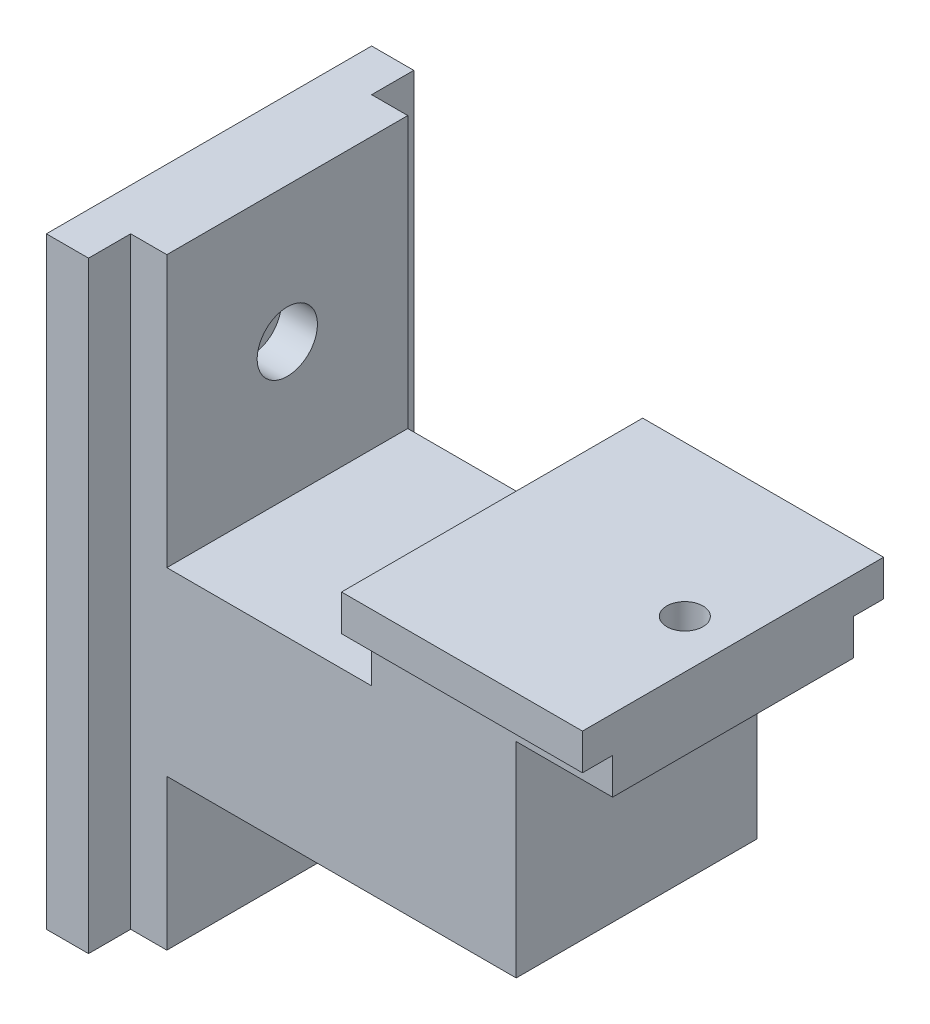
ISO-10303-21;
HEADER;
FILE_DESCRIPTION(('STEP AP214'),'2;1');
FILE_NAME('part.step','',(''),(''),'','','');
FILE_SCHEMA(('AUTOMOTIVE_DESIGN { 1 0 10303 214 1 1 1 1 }'));
ENDSEC;
DATA;
#1=APPLICATION_CONTEXT('core data for automotive mechanical design processes');
#2=APPLICATION_PROTOCOL_DEFINITION('international standard','automotive_design',2000,#1);
#3=PRODUCT_CONTEXT('',#1,'mechanical');
#4=PRODUCT('Part','Part','',(#3));
#5=PRODUCT_RELATED_PRODUCT_CATEGORY('part','',(#4));
#6=PRODUCT_DEFINITION_FORMATION('','',#4);
#7=PRODUCT_DEFINITION_CONTEXT('part definition',#1,'design');
#8=PRODUCT_DEFINITION('design','',#6,#7);
#9=PRODUCT_DEFINITION_SHAPE('','',#8);
#10=(LENGTH_UNIT() NAMED_UNIT(*) SI_UNIT(.MILLI.,.METRE.));
#11=(NAMED_UNIT(*) PLANE_ANGLE_UNIT() SI_UNIT($,.RADIAN.));
#12=(NAMED_UNIT(*) SI_UNIT($,.STERADIAN.) SOLID_ANGLE_UNIT());
#13=UNCERTAINTY_MEASURE_WITH_UNIT(LENGTH_MEASURE(1.E-05),#10,'distance_accuracy_value','');
#14=(GEOMETRIC_REPRESENTATION_CONTEXT(3) GLOBAL_UNCERTAINTY_ASSIGNED_CONTEXT((#13)) GLOBAL_UNIT_ASSIGNED_CONTEXT((#10,
#11,#12)) REPRESENTATION_CONTEXT('',''));
#15=CARTESIAN_POINT('',(0.,0.,0.));
#16=DIRECTION('',(0.,0.,1.));
#17=DIRECTION('',(1.,0.,0.));
#18=AXIS2_PLACEMENT_3D('',#15,#16,#17);
#19=CARTESIAN_POINT('',(4.00000000000001,30.,0.));
#20=DIRECTION('',(0.,-1.,0.));
#21=DIRECTION('',(1.,0.,0.));
#22=AXIS2_PLACEMENT_3D('',#19,#20,#21);
#23=CYLINDRICAL_SURFACE('',#22,1.5);
#24=CARTESIAN_POINT('',(4.,15.5,0.));
#25=DIRECTION('',(0.,-1.,0.));
#26=DIRECTION('',(1.,0.,0.));
#27=AXIS2_PLACEMENT_3D('',#24,#25,#26);
#28=CIRCLE('',#27,1.5);
#29=CARTESIAN_POINT('',(5.5,15.5,0.));
#30=VERTEX_POINT('',#29);
#31=EDGE_CURVE('E187',#30,#30,#28,.T.);
#32=ORIENTED_EDGE('',*,*,#31,.F.);
#33=EDGE_LOOP('',(#32));
#34=FACE_BOUND('',#33,.T.);
#35=CARTESIAN_POINT('',(4.,11.5,0.));
#36=DIRECTION('',(0.,-1.,0.));
#37=DIRECTION('',(1.,0.,0.));
#38=AXIS2_PLACEMENT_3D('',#35,#36,#37);
#39=CIRCLE('',#38,1.5);
#40=CARTESIAN_POINT('',(5.5,11.5,0.));
#41=VERTEX_POINT('',#40);
#42=EDGE_CURVE('E20',#41,#41,#39,.F.);
#43=ORIENTED_EDGE('',*,*,#42,.F.);
#44=EDGE_LOOP('',(#43));
#45=FACE_BOUND('',#44,.T.);
#46=ADVANCED_FACE('F17',(#34,#45),#23,.F.);
#47=CARTESIAN_POINT('',(4.,11.5,0.));
#48=DIRECTION('',(0.,-1.,0.));
#49=DIRECTION('',(1.,0.,0.));
#50=AXIS2_PLACEMENT_3D('',#47,#48,#49);
#51=PLANE('',#50);
#52=CARTESIAN_POINT('',(4.,11.5,0.));
#53=DIRECTION('',(0.,-1.,0.));
#54=DIRECTION('',(1.,0.,0.));
#55=AXIS2_PLACEMENT_3D('',#52,#53,#54);
#56=CIRCLE('',#55,2.5);
#57=CARTESIAN_POINT('',(6.5,11.5,0.));
#58=VERTEX_POINT('',#57);
#59=EDGE_CURVE('E166',#58,#58,#56,.T.);
#60=ORIENTED_EDGE('',*,*,#59,.T.);
#61=EDGE_LOOP('',(#60));
#62=FACE_BOUND('',#61,.T.);
#63=ORIENTED_EDGE('',*,*,#42,.T.);
#64=EDGE_LOOP('',(#63));
#65=FACE_BOUND('',#64,.T.);
#66=ADVANCED_FACE('F217',(#62,#65),#51,.T.);
#67=CARTESIAN_POINT('',(7.99999999999999,15.5,12.5));
#68=DIRECTION('',(0.,0.,-1.));
#69=DIRECTION('',(-1.,0.,0.));
#70=AXIS2_PLACEMENT_3D('',#67,#68,#69);
#71=PLANE('',#70);
#72=DIRECTION('',(0.,-1.,0.));
#73=VECTOR('',#72,1.);
#74=CARTESIAN_POINT('',(7.99999999999999,15.5,12.5));
#75=LINE('',#74,#73);
#76=CARTESIAN_POINT('',(7.99999999999999,12.5,12.5));
#77=VERTEX_POINT('',#76);
#78=CARTESIAN_POINT('',(7.99999999999999,15.5,12.5));
#79=VERTEX_POINT('',#78);
#80=EDGE_CURVE('E329',#77,#79,#75,.F.);
#81=ORIENTED_EDGE('',*,*,#80,.T.);
#82=DIRECTION('',(-1.,0.,0.));
#83=VECTOR('',#82,1.);
#84=CARTESIAN_POINT('',(0.,15.5,12.5));
#85=LINE('',#84,#83);
#86=CARTESIAN_POINT('',(-12.,15.5,12.5));
#87=VERTEX_POINT('',#86);
#88=EDGE_CURVE('E150',#87,#79,#85,.F.);
#89=ORIENTED_EDGE('',*,*,#88,.F.);
#90=DIRECTION('',(0.,1.,0.));
#91=VECTOR('',#90,1.);
#92=CARTESIAN_POINT('',(-12.,7.5,12.5));
#93=LINE('',#92,#91);
#94=CARTESIAN_POINT('',(-12.,12.5,12.5));
#95=VERTEX_POINT('',#94);
#96=EDGE_CURVE('E179',#87,#95,#93,.F.);
#97=ORIENTED_EDGE('',*,*,#96,.T.);
#98=DIRECTION('',(-1.,0.,0.));
#99=VECTOR('',#98,1.);
#100=CARTESIAN_POINT('',(0.,12.5,12.5));
#101=LINE('',#100,#99);
#102=EDGE_CURVE('E175',#95,#77,#101,.F.);
#103=ORIENTED_EDGE('',*,*,#102,.T.);
#104=EDGE_LOOP('',(#81,#89,#97,#103));
#105=FACE_BOUND('',#104,.T.);
#106=ADVANCED_FACE('F225',(#105),#71,.F.);
#107=CARTESIAN_POINT('',(0.,15.5,0.));
#108=DIRECTION('',(0.,1.,0.));
#109=DIRECTION('',(-1.,0.,0.));
#110=AXIS2_PLACEMENT_3D('',#107,#108,#109);
#111=PLANE('',#110);
#112=DIRECTION('',(0.,0.,1.));
#113=VECTOR('',#112,1.);
#114=CARTESIAN_POINT('',(7.99999999999999,15.5,12.5));
#115=LINE('',#114,#113);
#116=CARTESIAN_POINT('',(7.99999999999999,15.5,-12.5));
#117=VERTEX_POINT('',#116);
#118=EDGE_CURVE('E163',#79,#117,#115,.F.);
#119=ORIENTED_EDGE('',*,*,#118,.T.);
#120=DIRECTION('',(1.,0.,0.));
#121=VECTOR('',#120,1.);
#122=CARTESIAN_POINT('',(7.99999999999999,15.5,-12.5));
#123=LINE('',#122,#121);
#124=CARTESIAN_POINT('',(-12.,15.5,-12.5));
#125=VERTEX_POINT('',#124);
#126=EDGE_CURVE('E155',#117,#125,#123,.F.);
#127=ORIENTED_EDGE('',*,*,#126,.T.);
#128=DIRECTION('',(0.,0.,1.));
#129=VECTOR('',#128,1.);
#130=CARTESIAN_POINT('',(-12.,15.5,10.));
#131=LINE('',#130,#129);
#132=EDGE_CURVE('E160',#125,#87,#131,.T.);
#133=ORIENTED_EDGE('',*,*,#132,.T.);
#134=ORIENTED_EDGE('',*,*,#88,.T.);
#135=EDGE_LOOP('',(#119,#127,#133,#134));
#136=FACE_BOUND('',#135,.T.);
#137=ORIENTED_EDGE('',*,*,#31,.T.);
#138=EDGE_LOOP('',(#137));
#139=FACE_BOUND('',#138,.T.);
#140=ADVANCED_FACE('F157',(#136,#139),#111,.T.);
#141=CARTESIAN_POINT('',(7.99999999999999,15.5,-12.5));
#142=DIRECTION('',(0.,0.,1.));
#143=DIRECTION('',(1.,0.,0.));
#144=AXIS2_PLACEMENT_3D('',#141,#142,#143);
#145=PLANE('',#144);
#146=DIRECTION('',(0.,1.,0.));
#147=VECTOR('',#146,1.);
#148=CARTESIAN_POINT('',(-12.,7.5,-12.5));
#149=LINE('',#148,#147);
#150=CARTESIAN_POINT('',(-12.,12.5,-12.5));
#151=VERTEX_POINT('',#150);
#152=EDGE_CURVE('E169',#151,#125,#149,.T.);
#153=ORIENTED_EDGE('',*,*,#152,.T.);
#154=ORIENTED_EDGE('',*,*,#126,.F.);
#155=DIRECTION('',(0.,-1.,0.));
#156=VECTOR('',#155,1.);
#157=CARTESIAN_POINT('',(7.99999999999999,15.5,-12.5));
#158=LINE('',#157,#156);
#159=CARTESIAN_POINT('',(7.99999999999999,12.5,-12.5));
#160=VERTEX_POINT('',#159);
#161=EDGE_CURVE('E336',#117,#160,#158,.T.);
#162=ORIENTED_EDGE('',*,*,#161,.T.);
#163=DIRECTION('',(-1.,0.,0.));
#164=VECTOR('',#163,1.);
#165=CARTESIAN_POINT('',(0.,12.5,-12.5));
#166=LINE('',#165,#164);
#167=EDGE_CURVE('E172',#160,#151,#166,.T.);
#168=ORIENTED_EDGE('',*,*,#167,.T.);
#169=EDGE_LOOP('',(#153,#154,#162,#168));
#170=FACE_BOUND('',#169,.T.);
#171=ADVANCED_FACE('F170',(#170),#145,.F.);
#172=CARTESIAN_POINT('',(4.,11.5,0.));
#173=DIRECTION('',(0.,-1.,0.));
#174=DIRECTION('',(1.,0.,0.));
#175=AXIS2_PLACEMENT_3D('',#172,#173,#174);
#176=CYLINDRICAL_SURFACE('',#175,2.5);
#177=ORIENTED_EDGE('',*,*,#59,.F.);
#178=EDGE_LOOP('',(#177));
#179=FACE_BOUND('',#178,.T.);
#180=CARTESIAN_POINT('',(4.,9.5,0.));
#181=DIRECTION('',(0.,-1.,0.));
#182=DIRECTION('',(1.,0.,0.));
#183=AXIS2_PLACEMENT_3D('',#180,#181,#182);
#184=CIRCLE('',#183,2.5);
#185=CARTESIAN_POINT('',(6.49999999999999,9.5,0.));
#186=VERTEX_POINT('',#185);
#187=EDGE_CURVE('E206',#186,#186,#184,.T.);
#188=ORIENTED_EDGE('',*,*,#187,.T.);
#189=EDGE_LOOP('',(#188));
#190=FACE_BOUND('',#189,.T.);
#191=ADVANCED_FACE('F316',(#179,#190),#176,.F.);
#192=CARTESIAN_POINT('',(-32.,18.75,0.));
#193=DIRECTION('',(1.,0.,0.));
#194=DIRECTION('',(0.,0.,-1.));
#195=AXIS2_PLACEMENT_3D('',#192,#193,#194);
#196=CYLINDRICAL_SURFACE('',#195,2.5);
#197=CARTESIAN_POINT('',(-29.,18.75,0.));
#198=DIRECTION('',(1.,0.,0.));
#199=DIRECTION('',(0.,0.,-1.));
#200=AXIS2_PLACEMENT_3D('',#197,#198,#199);
#201=CIRCLE('',#200,2.5);
#202=CARTESIAN_POINT('',(-29.,18.75,-2.49999999999999));
#203=VERTEX_POINT('',#202);
#204=EDGE_CURVE('E198',#203,#203,#201,.F.);
#205=ORIENTED_EDGE('',*,*,#204,.F.);
#206=EDGE_LOOP('',(#205));
#207=FACE_BOUND('',#206,.T.);
#208=CARTESIAN_POINT('',(-32.,18.75,0.));
#209=DIRECTION('',(1.,0.,0.));
#210=DIRECTION('',(0.,0.,-1.));
#211=AXIS2_PLACEMENT_3D('',#208,#209,#210);
#212=CIRCLE('',#211,2.5);
#213=CARTESIAN_POINT('',(-32.,18.75,-2.49999999999999));
#214=VERTEX_POINT('',#213);
#215=EDGE_CURVE('E202',#214,#214,#212,.T.);
#216=ORIENTED_EDGE('',*,*,#215,.F.);
#217=EDGE_LOOP('',(#216));
#218=FACE_BOUND('',#217,.T.);
#219=ADVANCED_FACE('F312',(#207,#218),#196,.F.);
#220=CARTESIAN_POINT('',(0.,12.5,0.));
#221=DIRECTION('',(0.,1.,0.));
#222=DIRECTION('',(-1.,0.,0.));
#223=AXIS2_PLACEMENT_3D('',#220,#221,#222);
#224=PLANE('',#223);
#225=DIRECTION('',(0.,0.,1.));
#226=VECTOR('',#225,1.);
#227=CARTESIAN_POINT('',(7.99999999999999,12.5,12.5));
#228=LINE('',#227,#226);
#229=CARTESIAN_POINT('',(7.99999999999999,12.5,10.));
#230=VERTEX_POINT('',#229);
#231=EDGE_CURVE('E210',#230,#77,#228,.T.);
#232=ORIENTED_EDGE('',*,*,#231,.T.);
#233=ORIENTED_EDGE('',*,*,#102,.F.);
#234=DIRECTION('',(0.,0.,1.));
#235=VECTOR('',#234,1.);
#236=CARTESIAN_POINT('',(-12.,12.5,10.));
#237=LINE('',#236,#235);
#238=CARTESIAN_POINT('',(-12.,12.5,10.));
#239=VERTEX_POINT('',#238);
#240=EDGE_CURVE('E181',#95,#239,#237,.F.);
#241=ORIENTED_EDGE('',*,*,#240,.T.);
#242=DIRECTION('',(-1.,0.,0.));
#243=VECTOR('',#242,1.);
#244=CARTESIAN_POINT('',(0.,12.5,10.));
#245=LINE('',#244,#243);
#246=EDGE_CURVE('E347',#239,#230,#245,.F.);
#247=ORIENTED_EDGE('',*,*,#246,.T.);
#248=EDGE_LOOP('',(#232,#233,#241,#247));
#249=FACE_BOUND('',#248,.T.);
#250=ADVANCED_FACE('F308',(#249),#224,.F.);
#251=CARTESIAN_POINT('',(0.,-7.5,10.));
#252=DIRECTION('',(0.,1.,0.));
#253=DIRECTION('',(-1.,0.,0.));
#254=AXIS2_PLACEMENT_3D('',#251,#252,#253);
#255=PLANE('',#254);
#256=DIRECTION('',(0.,0.,-1.));
#257=VECTOR('',#256,1.);
#258=CARTESIAN_POINT('',(-29.,-7.5,-10.));
#259=LINE('',#258,#257);
#260=CARTESIAN_POINT('',(-29.,-7.5,-10.));
#261=VERTEX_POINT('',#260);
#262=CARTESIAN_POINT('',(-29.,-7.5,10.));
#263=VERTEX_POINT('',#262);
#264=EDGE_CURVE('E399',#261,#263,#259,.F.);
#265=ORIENTED_EDGE('',*,*,#264,.F.);
#266=DIRECTION('',(-1.,0.,0.));
#267=VECTOR('',#266,1.);
#268=CARTESIAN_POINT('',(0.,-7.5,-10.));
#269=LINE('',#268,#267);
#270=CARTESIAN_POINT('',(0.,-7.5,-10.));
#271=VERTEX_POINT('',#270);
#272=EDGE_CURVE('E393',#271,#261,#269,.T.);
#273=ORIENTED_EDGE('',*,*,#272,.F.);
#274=DIRECTION('',(0.,0.,1.));
#275=VECTOR('',#274,1.);
#276=CARTESIAN_POINT('',(0.,-7.5,10.));
#277=LINE('',#276,#275);
#278=CARTESIAN_POINT('',(0.,-7.5,10.));
#279=VERTEX_POINT('',#278);
#280=EDGE_CURVE('E364',#271,#279,#277,.T.);
#281=ORIENTED_EDGE('',*,*,#280,.T.);
#282=DIRECTION('',(-1.,0.,0.));
#283=VECTOR('',#282,1.);
#284=CARTESIAN_POINT('',(0.,-7.5,10.));
#285=LINE('',#284,#283);
#286=EDGE_CURVE('E409',#279,#263,#285,.T.);
#287=ORIENTED_EDGE('',*,*,#286,.T.);
#288=EDGE_LOOP('',(#265,#273,#281,#287));
#289=FACE_BOUND('',#288,.T.);
#290=ADVANCED_FACE('F304',(#289),#255,.F.);
#291=CARTESIAN_POINT('',(-32.,7.50000000000001,10.));
#292=DIRECTION('',(0.,-1.,0.));
#293=DIRECTION('',(1.,0.,0.));
#294=AXIS2_PLACEMENT_3D('',#291,#292,#293);
#295=PLANE('',#294);
#296=DIRECTION('',(0.,0.,-1.));
#297=VECTOR('',#296,1.);
#298=CARTESIAN_POINT('',(-29.,7.5,-10.));
#299=LINE('',#298,#297);
#300=CARTESIAN_POINT('',(-29.,7.5,10.));
#301=VERTEX_POINT('',#300);
#302=CARTESIAN_POINT('',(-29.,7.5,-10.));
#303=VERTEX_POINT('',#302);
#304=EDGE_CURVE('E201',#301,#303,#299,.T.);
#305=ORIENTED_EDGE('',*,*,#304,.F.);
#306=DIRECTION('',(-1.,0.,0.));
#307=VECTOR('',#306,1.);
#308=CARTESIAN_POINT('',(0.,7.50000000000001,10.));
#309=LINE('',#308,#307);
#310=CARTESIAN_POINT('',(-12.,7.5,10.));
#311=VERTEX_POINT('',#310);
#312=EDGE_CURVE('E402',#301,#311,#309,.F.);
#313=ORIENTED_EDGE('',*,*,#312,.T.);
#314=DIRECTION('',(0.,0.,1.));
#315=VECTOR('',#314,1.);
#316=CARTESIAN_POINT('',(-12.,7.5,10.));
#317=LINE('',#316,#315);
#318=CARTESIAN_POINT('',(-12.,7.5,-10.));
#319=VERTEX_POINT('',#318);
#320=EDGE_CURVE('E344',#311,#319,#317,.F.);
#321=ORIENTED_EDGE('',*,*,#320,.T.);
#322=DIRECTION('',(-1.,0.,0.));
#323=VECTOR('',#322,1.);
#324=CARTESIAN_POINT('',(0.,7.50000000000001,-10.));
#325=LINE('',#324,#323);
#326=EDGE_CURVE('E382',#303,#319,#325,.F.);
#327=ORIENTED_EDGE('',*,*,#326,.F.);
#328=EDGE_LOOP('',(#305,#313,#321,#327));
#329=FACE_BOUND('',#328,.T.);
#330=ADVANCED_FACE('F301',(#329),#295,.F.);
#331=CARTESIAN_POINT('',(-12.,7.5,10.));
#332=DIRECTION('',(1.,0.,0.));
#333=DIRECTION('',(0.,1.,0.));
#334=AXIS2_PLACEMENT_3D('',#331,#332,#333);
#335=PLANE('',#334);
#336=ORIENTED_EDGE('',*,*,#320,.F.);
#337=DIRECTION('',(0.,1.,0.));
#338=VECTOR('',#337,1.);
#339=CARTESIAN_POINT('',(-12.,0.,10.));
#340=LINE('',#339,#338);
#341=EDGE_CURVE('E349',#311,#239,#340,.T.);
#342=ORIENTED_EDGE('',*,*,#341,.T.);
#343=ORIENTED_EDGE('',*,*,#240,.F.);
#344=ORIENTED_EDGE('',*,*,#96,.F.);
#345=ORIENTED_EDGE('',*,*,#132,.F.);
#346=ORIENTED_EDGE('',*,*,#152,.F.);
#347=DIRECTION('',(0.,0.,1.));
#348=VECTOR('',#347,1.);
#349=CARTESIAN_POINT('',(-12.,12.5,0.));
#350=LINE('',#349,#348);
#351=CARTESIAN_POINT('',(-12.,12.5,-10.));
#352=VERTEX_POINT('',#351);
#353=EDGE_CURVE('E333',#151,#352,#350,.T.);
#354=ORIENTED_EDGE('',*,*,#353,.T.);
#355=DIRECTION('',(0.,1.,0.));
#356=VECTOR('',#355,1.);
#357=CARTESIAN_POINT('',(-12.,0.,-10.));
#358=LINE('',#357,#356);
#359=EDGE_CURVE('E380',#319,#352,#358,.T.);
#360=ORIENTED_EDGE('',*,*,#359,.F.);
#361=EDGE_LOOP('',(#336,#342,#343,#344,#345,#346,#354,#360));
#362=FACE_BOUND('',#361,.T.);
#363=ADVANCED_FACE('F177',(#362),#335,.F.);
#364=CARTESIAN_POINT('',(0.,12.5,0.));
#365=DIRECTION('',(0.,1.,0.));
#366=DIRECTION('',(-1.,0.,0.));
#367=AXIS2_PLACEMENT_3D('',#364,#365,#366);
#368=PLANE('',#367);
#369=DIRECTION('',(-1.,0.,0.));
#370=VECTOR('',#369,1.);
#371=CARTESIAN_POINT('',(0.,12.5,-10.));
#372=LINE('',#371,#370);
#373=CARTESIAN_POINT('',(7.99999999999999,12.5,-10.));
#374=VERTEX_POINT('',#373);
#375=EDGE_CURVE('E370',#352,#374,#372,.F.);
#376=ORIENTED_EDGE('',*,*,#375,.F.);
#377=ORIENTED_EDGE('',*,*,#353,.F.);
#378=ORIENTED_EDGE('',*,*,#167,.F.);
#379=DIRECTION('',(0.,0.,1.));
#380=VECTOR('',#379,1.);
#381=CARTESIAN_POINT('',(7.99999999999999,12.5,12.5));
#382=LINE('',#381,#380);
#383=EDGE_CURVE('E338',#160,#374,#382,.T.);
#384=ORIENTED_EDGE('',*,*,#383,.T.);
#385=EDGE_LOOP('',(#376,#377,#378,#384));
#386=FACE_BOUND('',#385,.T.);
#387=ADVANCED_FACE('F294',(#386),#368,.F.);
#388=CARTESIAN_POINT('',(7.99999999999999,15.5,12.5));
#389=DIRECTION('',(-1.,0.,0.));
#390=DIRECTION('',(0.,-1.,0.));
#391=AXIS2_PLACEMENT_3D('',#388,#389,#390);
#392=PLANE('',#391);
#393=DIRECTION('',(0.,1.,0.));
#394=VECTOR('',#393,1.);
#395=CARTESIAN_POINT('',(7.99999999999999,0.,10.));
#396=LINE('',#395,#394);
#397=CARTESIAN_POINT('',(7.99999999999998,9.49999999999999,10.));
#398=VERTEX_POINT('',#397);
#399=EDGE_CURVE('E356',#230,#398,#396,.F.);
#400=ORIENTED_EDGE('',*,*,#399,.T.);
#401=DIRECTION('',(0.,0.,1.));
#402=VECTOR('',#401,1.);
#403=CARTESIAN_POINT('',(7.99999999999998,9.49999999999999,-10.));
#404=LINE('',#403,#402);
#405=CARTESIAN_POINT('',(7.99999999999999,9.49999999999998,-10.));
#406=VERTEX_POINT('',#405);
#407=EDGE_CURVE('E209',#398,#406,#404,.F.);
#408=ORIENTED_EDGE('',*,*,#407,.T.);
#409=DIRECTION('',(0.,1.,0.));
#410=VECTOR('',#409,1.);
#411=CARTESIAN_POINT('',(7.99999999999999,0.,-10.));
#412=LINE('',#411,#410);
#413=EDGE_CURVE('E373',#374,#406,#412,.F.);
#414=ORIENTED_EDGE('',*,*,#413,.F.);
#415=ORIENTED_EDGE('',*,*,#383,.F.);
#416=ORIENTED_EDGE('',*,*,#161,.F.);
#417=ORIENTED_EDGE('',*,*,#118,.F.);
#418=ORIENTED_EDGE('',*,*,#80,.F.);
#419=ORIENTED_EDGE('',*,*,#231,.F.);
#420=EDGE_LOOP('',(#400,#408,#414,#415,#416,#417,#418,#419));
#421=FACE_BOUND('',#420,.T.);
#422=ADVANCED_FACE('F290',(#421),#392,.F.);
#423=CARTESIAN_POINT('',(28.2237484161567,9.49999999999998,-10.));
#424=DIRECTION('',(0.,1.,0.));
#425=DIRECTION('',(-1.,0.,0.));
#426=AXIS2_PLACEMENT_3D('',#423,#424,#425);
#427=PLANE('',#426);
#428=ORIENTED_EDGE('',*,*,#407,.F.);
#429=DIRECTION('',(-1.,0.,0.));
#430=VECTOR('',#429,1.);
#431=CARTESIAN_POINT('',(0.,9.49999999999999,10.));
#432=LINE('',#431,#430);
#433=CARTESIAN_POINT('',(0.,9.5,10.));
#434=VERTEX_POINT('',#433);
#435=EDGE_CURVE('E358',#398,#434,#432,.T.);
#436=ORIENTED_EDGE('',*,*,#435,.T.);
#437=DIRECTION('',(0.,0.,1.));
#438=VECTOR('',#437,1.);
#439=CARTESIAN_POINT('',(0.,9.5,10.));
#440=LINE('',#439,#438);
#441=CARTESIAN_POINT('',(0.,9.5,-10.));
#442=VERTEX_POINT('',#441);
#443=EDGE_CURVE('E205',#434,#442,#440,.F.);
#444=ORIENTED_EDGE('',*,*,#443,.T.);
#445=DIRECTION('',(-1.,0.,0.));
#446=VECTOR('',#445,1.);
#447=CARTESIAN_POINT('',(0.,9.49999999999998,-10.));
#448=LINE('',#447,#446);
#449=EDGE_CURVE('E377',#406,#442,#448,.T.);
#450=ORIENTED_EDGE('',*,*,#449,.F.);
#451=EDGE_LOOP('',(#428,#436,#444,#450));
#452=FACE_BOUND('',#451,.T.);
#453=ORIENTED_EDGE('',*,*,#187,.F.);
#454=EDGE_LOOP('',(#453));
#455=FACE_BOUND('',#454,.T.);
#456=ADVANCED_FACE('F286',(#452,#455),#427,.F.);
#457=CARTESIAN_POINT('',(0.,12.5,10.));
#458=DIRECTION('',(-1.,0.,0.));
#459=DIRECTION('',(0.,-1.,0.));
#460=AXIS2_PLACEMENT_3D('',#457,#458,#459);
#461=PLANE('',#460);
#462=DIRECTION('',(0.,1.,0.));
#463=VECTOR('',#462,1.);
#464=CARTESIAN_POINT('',(0.,0.,10.));
#465=LINE('',#464,#463);
#466=EDGE_CURVE('E411',#434,#279,#465,.F.);
#467=ORIENTED_EDGE('',*,*,#466,.T.);
#468=ORIENTED_EDGE('',*,*,#280,.F.);
#469=DIRECTION('',(0.,1.,0.));
#470=VECTOR('',#469,1.);
#471=CARTESIAN_POINT('',(0.,0.,-10.));
#472=LINE('',#471,#470);
#473=EDGE_CURVE('E420',#442,#271,#472,.F.);
#474=ORIENTED_EDGE('',*,*,#473,.F.);
#475=ORIENTED_EDGE('',*,*,#443,.F.);
#476=EDGE_LOOP('',(#467,#468,#474,#475));
#477=FACE_BOUND('',#476,.T.);
#478=ADVANCED_FACE('F282',(#477),#461,.F.);
#479=CARTESIAN_POINT('',(-32.,0.,0.));
#480=DIRECTION('',(1.,0.,0.));
#481=DIRECTION('',(0.,0.,-1.));
#482=AXIS2_PLACEMENT_3D('',#479,#480,#481);
#483=PLANE('',#482);
#484=ORIENTED_EDGE('',*,*,#215,.T.);
#485=EDGE_LOOP('',(#484));
#486=FACE_BOUND('',#485,.T.);
#487=CARTESIAN_POINT('',(-32.,18.75,0.));
#488=DIRECTION('',(1.,0.,0.));
#489=DIRECTION('',(0.,0.,-1.));
#490=AXIS2_PLACEMENT_3D('',#487,#488,#489);
#491=CIRCLE('',#490,1.5);
#492=CARTESIAN_POINT('',(-32.,18.75,-1.5));
#493=VERTEX_POINT('',#492);
#494=EDGE_CURVE('E193',#493,#493,#491,.F.);
#495=ORIENTED_EDGE('',*,*,#494,.T.);
#496=EDGE_LOOP('',(#495));
#497=FACE_BOUND('',#496,.T.);
#498=ADVANCED_FACE('F278',(#486,#497),#483,.T.);
#499=CARTESIAN_POINT('',(-29.,-20.,-10.));
#500=DIRECTION('',(1.,0.,0.));
#501=DIRECTION('',(0.,0.,-1.));
#502=AXIS2_PLACEMENT_3D('',#499,#500,#501);
#503=PLANE('',#502);
#504=DIRECTION('',(0.,0.,1.));
#505=VECTOR('',#504,1.);
#506=CARTESIAN_POINT('',(-29.,30.,0.));
#507=LINE('',#506,#505);
#508=CARTESIAN_POINT('',(-29.,30.,10.));
#509=VERTEX_POINT('',#508);
#510=CARTESIAN_POINT('',(-29.,30.,-10.));
#511=VERTEX_POINT('',#510);
#512=EDGE_CURVE('E439',#509,#511,#507,.F.);
#513=ORIENTED_EDGE('',*,*,#512,.F.);
#514=DIRECTION('',(0.,1.,0.));
#515=VECTOR('',#514,1.);
#516=CARTESIAN_POINT('',(-29.,0.,10.));
#517=LINE('',#516,#515);
#518=EDGE_CURVE('E404',#509,#301,#517,.F.);
#519=ORIENTED_EDGE('',*,*,#518,.T.);
#520=ORIENTED_EDGE('',*,*,#304,.T.);
#521=DIRECTION('',(0.,1.,0.));
#522=VECTOR('',#521,1.);
#523=CARTESIAN_POINT('',(-29.,0.,-10.));
#524=LINE('',#523,#522);
#525=EDGE_CURVE('E387',#511,#303,#524,.F.);
#526=ORIENTED_EDGE('',*,*,#525,.F.);
#527=EDGE_LOOP('',(#513,#519,#520,#526));
#528=FACE_BOUND('',#527,.T.);
#529=ORIENTED_EDGE('',*,*,#204,.T.);
#530=EDGE_LOOP('',(#529));
#531=FACE_BOUND('',#530,.T.);
#532=ADVANCED_FACE('F274',(#528,#531),#503,.T.);
#533=CARTESIAN_POINT('',(-32.,-20.,13.5));
#534=DIRECTION('',(1.,0.,0.));
#535=DIRECTION('',(0.,0.,-1.));
#536=AXIS2_PLACEMENT_3D('',#533,#534,#535);
#537=PLANE('',#536);
#538=DIRECTION('',(0.,0.,1.));
#539=VECTOR('',#538,1.);
#540=CARTESIAN_POINT('',(-32.,30.,0.));
#541=LINE('',#540,#539);
#542=CARTESIAN_POINT('',(-32.,30.,13.5));
#543=VERTEX_POINT('',#542);
#544=CARTESIAN_POINT('',(-32.,30.,10.));
#545=VERTEX_POINT('',#544);
#546=EDGE_CURVE('E433',#543,#545,#541,.F.);
#547=ORIENTED_EDGE('',*,*,#546,.F.);
#548=DIRECTION('',(0.,1.,0.));
#549=VECTOR('',#548,1.);
#550=CARTESIAN_POINT('',(-32.,-20.,13.5));
#551=LINE('',#550,#549);
#552=CARTESIAN_POINT('',(-32.,-20.,13.5));
#553=VERTEX_POINT('',#552);
#554=EDGE_CURVE('E196',#553,#543,#551,.T.);
#555=ORIENTED_EDGE('',*,*,#554,.F.);
#556=DIRECTION('',(0.,0.,1.));
#557=VECTOR('',#556,1.);
#558=CARTESIAN_POINT('',(-32.,-20.,0.));
#559=LINE('',#558,#557);
#560=CARTESIAN_POINT('',(-32.,-20.,10.));
#561=VERTEX_POINT('',#560);
#562=EDGE_CURVE('E454',#553,#561,#559,.F.);
#563=ORIENTED_EDGE('',*,*,#562,.T.);
#564=DIRECTION('',(0.,1.,0.));
#565=VECTOR('',#564,1.);
#566=CARTESIAN_POINT('',(-32.,0.,10.));
#567=LINE('',#566,#565);
#568=EDGE_CURVE('E407',#561,#545,#567,.T.);
#569=ORIENTED_EDGE('',*,*,#568,.T.);
#570=EDGE_LOOP('',(#547,#555,#563,#569));
#571=FACE_BOUND('',#570,.T.);
#572=ADVANCED_FACE('F270',(#571),#537,.T.);
#573=CARTESIAN_POINT('',(0.,0.,10.));
#574=DIRECTION('',(0.,0.,-1.));
#575=DIRECTION('',(-1.,0.,0.));
#576=AXIS2_PLACEMENT_3D('',#573,#574,#575);
#577=PLANE('',#576);
#578=ORIENTED_EDGE('',*,*,#518,.F.);
#579=DIRECTION('',(1.,0.,0.));
#580=VECTOR('',#579,1.);
#581=CARTESIAN_POINT('',(0.,30.,10.));
#582=LINE('',#581,#580);
#583=EDGE_CURVE('E436',#545,#509,#582,.T.);
#584=ORIENTED_EDGE('',*,*,#583,.F.);
#585=ORIENTED_EDGE('',*,*,#568,.F.);
#586=DIRECTION('',(1.,0.,0.));
#587=VECTOR('',#586,1.);
#588=CARTESIAN_POINT('',(0.,-20.,10.));
#589=LINE('',#588,#587);
#590=CARTESIAN_POINT('',(-29.,-20.,10.));
#591=VERTEX_POINT('',#590);
#592=EDGE_CURVE('E456',#561,#591,#589,.T.);
#593=ORIENTED_EDGE('',*,*,#592,.T.);
#594=DIRECTION('',(0.,1.,0.));
#595=VECTOR('',#594,1.);
#596=CARTESIAN_POINT('',(-29.,-20.,10.));
#597=LINE('',#596,#595);
#598=EDGE_CURVE('E396',#263,#591,#597,.F.);
#599=ORIENTED_EDGE('',*,*,#598,.F.);
#600=ORIENTED_EDGE('',*,*,#286,.F.);
#601=ORIENTED_EDGE('',*,*,#466,.F.);
#602=ORIENTED_EDGE('',*,*,#435,.F.);
#603=ORIENTED_EDGE('',*,*,#399,.F.);
#604=ORIENTED_EDGE('',*,*,#246,.F.);
#605=ORIENTED_EDGE('',*,*,#341,.F.);
#606=ORIENTED_EDGE('',*,*,#312,.F.);
#607=EDGE_LOOP('',(#578,#584,#585,#593,#599,#600,#601,#602,#603,#604,#605,#606));
#608=FACE_BOUND('',#607,.T.);
#609=ADVANCED_FACE('F266',(#608),#577,.F.);
#610=CARTESIAN_POINT('',(-29.,-20.,-10.));
#611=DIRECTION('',(1.,0.,0.));
#612=DIRECTION('',(0.,0.,-1.));
#613=AXIS2_PLACEMENT_3D('',#610,#611,#612);
#614=PLANE('',#613);
#615=DIRECTION('',(0.,0.,1.));
#616=VECTOR('',#615,1.);
#617=CARTESIAN_POINT('',(-29.,-20.,0.));
#618=LINE('',#617,#616);
#619=CARTESIAN_POINT('',(-29.,-20.,-10.));
#620=VERTEX_POINT('',#619);
#621=EDGE_CURVE('E458',#591,#620,#618,.F.);
#622=ORIENTED_EDGE('',*,*,#621,.T.);
#623=DIRECTION('',(0.,1.,0.));
#624=VECTOR('',#623,1.);
#625=CARTESIAN_POINT('',(-29.,0.,-10.));
#626=LINE('',#625,#624);
#627=EDGE_CURVE('E390',#261,#620,#626,.F.);
#628=ORIENTED_EDGE('',*,*,#627,.F.);
#629=ORIENTED_EDGE('',*,*,#264,.T.);
#630=ORIENTED_EDGE('',*,*,#598,.T.);
#631=EDGE_LOOP('',(#622,#628,#629,#630));
#632=FACE_BOUND('',#631,.T.);
#633=ADVANCED_FACE('F262',(#632),#614,.T.);
#634=CARTESIAN_POINT('',(0.,0.,-10.));
#635=DIRECTION('',(0.,0.,-1.));
#636=DIRECTION('',(-1.,0.,0.));
#637=AXIS2_PLACEMENT_3D('',#634,#635,#636);
#638=PLANE('',#637);
#639=ORIENTED_EDGE('',*,*,#449,.T.);
#640=ORIENTED_EDGE('',*,*,#473,.T.);
#641=ORIENTED_EDGE('',*,*,#272,.T.);
#642=ORIENTED_EDGE('',*,*,#627,.T.);
#643=DIRECTION('',(1.,0.,0.));
#644=VECTOR('',#643,1.);
#645=CARTESIAN_POINT('',(0.,-20.,-10.));
#646=LINE('',#645,#644);
#647=CARTESIAN_POINT('',(-32.,-20.,-10.));
#648=VERTEX_POINT('',#647);
#649=EDGE_CURVE('E460',#620,#648,#646,.F.);
#650=ORIENTED_EDGE('',*,*,#649,.T.);
#651=DIRECTION('',(0.,1.,0.));
#652=VECTOR('',#651,1.);
#653=CARTESIAN_POINT('',(-32.,-20.,-10.));
#654=LINE('',#653,#652);
#655=CARTESIAN_POINT('',(-32.,30.,-10.));
#656=VERTEX_POINT('',#655);
#657=EDGE_CURVE('E197',#656,#648,#654,.F.);
#658=ORIENTED_EDGE('',*,*,#657,.F.);
#659=DIRECTION('',(1.,0.,0.));
#660=VECTOR('',#659,1.);
#661=CARTESIAN_POINT('',(0.,30.,-10.));
#662=LINE('',#661,#660);
#663=EDGE_CURVE('E442',#511,#656,#662,.F.);
#664=ORIENTED_EDGE('',*,*,#663,.F.);
#665=ORIENTED_EDGE('',*,*,#525,.T.);
#666=ORIENTED_EDGE('',*,*,#326,.T.);
#667=ORIENTED_EDGE('',*,*,#359,.T.);
#668=ORIENTED_EDGE('',*,*,#375,.T.);
#669=ORIENTED_EDGE('',*,*,#413,.T.);
#670=EDGE_LOOP('',(#639,#640,#641,#642,#650,#658,#664,#665,#666,#667,#668,#669));
#671=FACE_BOUND('',#670,.T.);
#672=ADVANCED_FACE('F258',(#671),#638,.T.);
#673=CARTESIAN_POINT('',(-32.,-20.,-10.));
#674=DIRECTION('',(1.,0.,0.));
#675=DIRECTION('',(0.,0.,-1.));
#676=AXIS2_PLACEMENT_3D('',#673,#674,#675);
#677=PLANE('',#676);
#678=ORIENTED_EDGE('',*,*,#657,.T.);
#679=DIRECTION('',(0.,0.,1.));
#680=VECTOR('',#679,1.);
#681=CARTESIAN_POINT('',(-32.,-20.,0.));
#682=LINE('',#681,#680);
#683=CARTESIAN_POINT('',(-32.,-20.,-13.5));
#684=VERTEX_POINT('',#683);
#685=EDGE_CURVE('E192',#648,#684,#682,.F.);
#686=ORIENTED_EDGE('',*,*,#685,.T.);
#687=DIRECTION('',(0.,1.,0.));
#688=VECTOR('',#687,1.);
#689=CARTESIAN_POINT('',(-32.,-20.,-13.5));
#690=LINE('',#689,#688);
#691=CARTESIAN_POINT('',(-32.,30.,-13.5));
#692=VERTEX_POINT('',#691);
#693=EDGE_CURVE('E448',#692,#684,#690,.F.);
#694=ORIENTED_EDGE('',*,*,#693,.F.);
#695=DIRECTION('',(0.,0.,1.));
#696=VECTOR('',#695,1.);
#697=CARTESIAN_POINT('',(-32.,30.,0.));
#698=LINE('',#697,#696);
#699=EDGE_CURVE('E428',#656,#692,#698,.F.);
#700=ORIENTED_EDGE('',*,*,#699,.F.);
#701=EDGE_LOOP('',(#678,#686,#694,#700));
#702=FACE_BOUND('',#701,.T.);
#703=ADVANCED_FACE('F254',(#702),#677,.T.);
#704=CARTESIAN_POINT('',(-39.7426406871193,18.75,0.));
#705=DIRECTION('',(1.,0.,0.));
#706=DIRECTION('',(0.,0.,-1.));
#707=AXIS2_PLACEMENT_3D('',#704,#705,#706);
#708=CYLINDRICAL_SURFACE('',#707,1.5);
#709=ORIENTED_EDGE('',*,*,#494,.F.);
#710=EDGE_LOOP('',(#709));
#711=FACE_BOUND('',#710,.T.);
#712=CARTESIAN_POINT('',(-35.5,18.75,0.));
#713=DIRECTION('',(1.,0.,0.));
#714=DIRECTION('',(0.,0.,-1.));
#715=AXIS2_PLACEMENT_3D('',#712,#713,#714);
#716=CIRCLE('',#715,1.5);
#717=CARTESIAN_POINT('',(-35.5,18.75,-1.49999999999999));
#718=VERTEX_POINT('',#717);
#719=EDGE_CURVE('E188',#718,#718,#716,.T.);
#720=ORIENTED_EDGE('',*,*,#719,.F.);
#721=EDGE_LOOP('',(#720));
#722=FACE_BOUND('',#721,.T.);
#723=ADVANCED_FACE('F250',(#711,#722),#708,.F.);
#724=CARTESIAN_POINT('',(-35.5,-20.,13.5));
#725=DIRECTION('',(0.,0.,1.));
#726=DIRECTION('',(1.,0.,0.));
#727=AXIS2_PLACEMENT_3D('',#724,#725,#726);
#728=PLANE('',#727);
#729=DIRECTION('',(0.,1.,0.));
#730=VECTOR('',#729,1.);
#731=CARTESIAN_POINT('',(-35.5,-20.,13.5));
#732=LINE('',#731,#730);
#733=CARTESIAN_POINT('',(-35.5,-20.,13.5));
#734=VERTEX_POINT('',#733);
#735=CARTESIAN_POINT('',(-35.5,30.,13.5));
#736=VERTEX_POINT('',#735);
#737=EDGE_CURVE('E191',#734,#736,#732,.T.);
#738=ORIENTED_EDGE('',*,*,#737,.F.);
#739=DIRECTION('',(1.,0.,0.));
#740=VECTOR('',#739,1.);
#741=CARTESIAN_POINT('',(0.,-20.,13.5));
#742=LINE('',#741,#740);
#743=EDGE_CURVE('E451',#734,#553,#742,.T.);
#744=ORIENTED_EDGE('',*,*,#743,.T.);
#745=ORIENTED_EDGE('',*,*,#554,.T.);
#746=DIRECTION('',(1.,0.,0.));
#747=VECTOR('',#746,1.);
#748=CARTESIAN_POINT('',(0.,30.,13.5));
#749=LINE('',#748,#747);
#750=EDGE_CURVE('E430',#736,#543,#749,.T.);
#751=ORIENTED_EDGE('',*,*,#750,.F.);
#752=EDGE_LOOP('',(#738,#744,#745,#751));
#753=FACE_BOUND('',#752,.T.);
#754=ADVANCED_FACE('F246',(#753),#728,.T.);
#755=CARTESIAN_POINT('',(0.,30.,0.));
#756=DIRECTION('',(0.,1.,0.));
#757=DIRECTION('',(0.,0.,1.));
#758=AXIS2_PLACEMENT_3D('',#755,#756,#757);
#759=PLANE('',#758);
#760=ORIENTED_EDGE('',*,*,#512,.T.);
#761=ORIENTED_EDGE('',*,*,#663,.T.);
#762=ORIENTED_EDGE('',*,*,#699,.T.);
#763=DIRECTION('',(-1.,0.,0.));
#764=VECTOR('',#763,1.);
#765=CARTESIAN_POINT('',(-32.,30.,-13.5));
#766=LINE('',#765,#764);
#767=CARTESIAN_POINT('',(-35.5,30.,-13.5));
#768=VERTEX_POINT('',#767);
#769=EDGE_CURVE('E445',#768,#692,#766,.F.);
#770=ORIENTED_EDGE('',*,*,#769,.F.);
#771=DIRECTION('',(0.,0.,1.));
#772=VECTOR('',#771,1.);
#773=CARTESIAN_POINT('',(-35.5,30.,-13.5));
#774=LINE('',#773,#772);
#775=EDGE_CURVE('E466',#736,#768,#774,.F.);
#776=ORIENTED_EDGE('',*,*,#775,.F.);
#777=ORIENTED_EDGE('',*,*,#750,.T.);
#778=ORIENTED_EDGE('',*,*,#546,.T.);
#779=ORIENTED_EDGE('',*,*,#583,.T.);
#780=EDGE_LOOP('',(#760,#761,#762,#770,#776,#777,#778,#779));
#781=FACE_BOUND('',#780,.T.);
#782=ADVANCED_FACE('F243',(#781),#759,.T.);
#783=CARTESIAN_POINT('',(-32.,-20.,-13.5));
#784=DIRECTION('',(0.,0.,-1.));
#785=DIRECTION('',(-1.,0.,0.));
#786=AXIS2_PLACEMENT_3D('',#783,#784,#785);
#787=PLANE('',#786);
#788=ORIENTED_EDGE('',*,*,#693,.T.);
#789=DIRECTION('',(1.,0.,0.));
#790=VECTOR('',#789,1.);
#791=CARTESIAN_POINT('',(0.,-20.,-13.5));
#792=LINE('',#791,#790);
#793=CARTESIAN_POINT('',(-35.5,-20.,-13.5));
#794=VERTEX_POINT('',#793);
#795=EDGE_CURVE('E35',#684,#794,#792,.F.);
#796=ORIENTED_EDGE('',*,*,#795,.T.);
#797=DIRECTION('',(0.,1.,0.));
#798=VECTOR('',#797,1.);
#799=CARTESIAN_POINT('',(-35.5,-20.,-13.5));
#800=LINE('',#799,#798);
#801=EDGE_CURVE('E26',#768,#794,#800,.F.);
#802=ORIENTED_EDGE('',*,*,#801,.F.);
#803=ORIENTED_EDGE('',*,*,#769,.T.);
#804=EDGE_LOOP('',(#788,#796,#802,#803));
#805=FACE_BOUND('',#804,.T.);
#806=ADVANCED_FACE('F235',(#805),#787,.T.);
#807=CARTESIAN_POINT('',(0.,-20.,0.));
#808=DIRECTION('',(0.,1.,0.));
#809=DIRECTION('',(0.,0.,1.));
#810=AXIS2_PLACEMENT_3D('',#807,#808,#809);
#811=PLANE('',#810);
#812=ORIENTED_EDGE('',*,*,#649,.F.);
#813=ORIENTED_EDGE('',*,*,#621,.F.);
#814=ORIENTED_EDGE('',*,*,#592,.F.);
#815=ORIENTED_EDGE('',*,*,#562,.F.);
#816=ORIENTED_EDGE('',*,*,#743,.F.);
#817=DIRECTION('',(0.,0.,1.));
#818=VECTOR('',#817,1.);
#819=CARTESIAN_POINT('',(-35.5,-20.,-13.5));
#820=LINE('',#819,#818);
#821=EDGE_CURVE('E11',#794,#734,#820,.T.);
#822=ORIENTED_EDGE('',*,*,#821,.F.);
#823=ORIENTED_EDGE('',*,*,#795,.F.);
#824=ORIENTED_EDGE('',*,*,#685,.F.);
#825=EDGE_LOOP('',(#812,#813,#814,#815,#816,#822,#823,#824));
#826=FACE_BOUND('',#825,.T.);
#827=ADVANCED_FACE('F229',(#826),#811,.F.);
#828=CARTESIAN_POINT('',(-35.5,-20.,-13.5));
#829=DIRECTION('',(-1.,0.,0.));
#830=DIRECTION('',(0.,0.,1.));
#831=AXIS2_PLACEMENT_3D('',#828,#829,#830);
#832=PLANE('',#831);
#833=ORIENTED_EDGE('',*,*,#801,.T.);
#834=ORIENTED_EDGE('',*,*,#821,.T.);
#835=ORIENTED_EDGE('',*,*,#737,.T.);
#836=ORIENTED_EDGE('',*,*,#775,.T.);
#837=EDGE_LOOP('',(#833,#834,#835,#836));
#838=FACE_BOUND('',#837,.T.);
#839=ORIENTED_EDGE('',*,*,#719,.T.);
#840=EDGE_LOOP('',(#839));
#841=FACE_BOUND('',#840,.T.);
#842=ADVANCED_FACE('F227',(#838,#841),#832,.T.);
#843=CLOSED_SHELL('',(#46,#66,#106,#140,#171,#191,#219,#250,#290,#330,#363,#387,#422,#456,#478,
#498,#532,#572,#609,#633,#672,#703,#723,#754,#782,#806,#827,#842));
#844=MANIFOLD_SOLID_BREP('B1',#843);
#845=ADVANCED_BREP_SHAPE_REPRESENTATION('',(#18,#844),#14);
#846=SHAPE_DEFINITION_REPRESENTATION(#9,#845);
ENDSEC;
END-ISO-10303-21;
